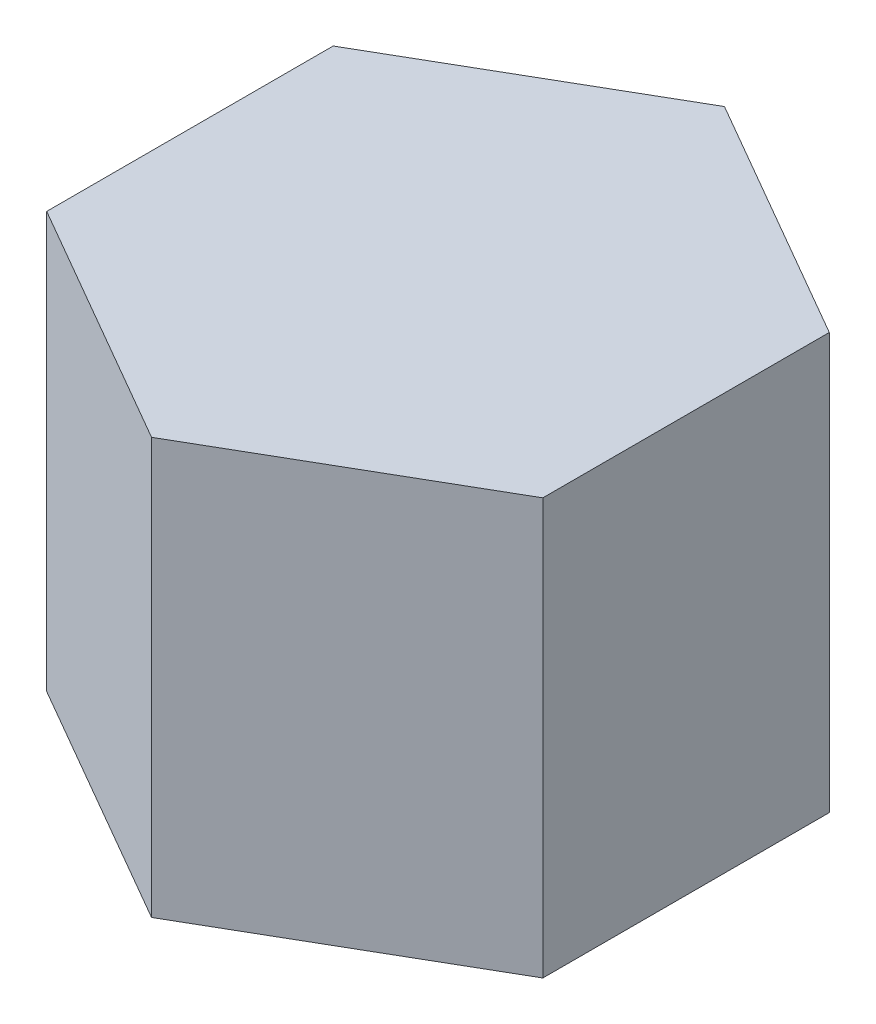
ISO-10303-21;
HEADER;
FILE_DESCRIPTION(('STEP AP214'),'2;1');
FILE_NAME('part.step','',(''),(''),'','','');
FILE_SCHEMA(('AUTOMOTIVE_DESIGN { 1 0 10303 214 1 1 1 1 }'));
ENDSEC;
DATA;
#1=APPLICATION_CONTEXT('core data for automotive mechanical design processes');
#2=APPLICATION_PROTOCOL_DEFINITION('international standard','automotive_design',2000,#1);
#3=PRODUCT_CONTEXT('',#1,'mechanical');
#4=PRODUCT('Part','Part','',(#3));
#5=PRODUCT_RELATED_PRODUCT_CATEGORY('part','',(#4));
#6=PRODUCT_DEFINITION_FORMATION('','',#4);
#7=PRODUCT_DEFINITION_CONTEXT('part definition',#1,'design');
#8=PRODUCT_DEFINITION('design','',#6,#7);
#9=PRODUCT_DEFINITION_SHAPE('','',#8);
#10=(LENGTH_UNIT() NAMED_UNIT(*) SI_UNIT(.MILLI.,.METRE.));
#11=(NAMED_UNIT(*) PLANE_ANGLE_UNIT() SI_UNIT($,.RADIAN.));
#12=(NAMED_UNIT(*) SI_UNIT($,.STERADIAN.) SOLID_ANGLE_UNIT());
#13=UNCERTAINTY_MEASURE_WITH_UNIT(LENGTH_MEASURE(1.E-05),#10,'distance_accuracy_value','');
#14=(GEOMETRIC_REPRESENTATION_CONTEXT(3) GLOBAL_UNCERTAINTY_ASSIGNED_CONTEXT((#13)) GLOBAL_UNIT_ASSIGNED_CONTEXT((#10,
#11,#12)) REPRESENTATION_CONTEXT('',''));
#15=CARTESIAN_POINT('',(0.,0.,0.));
#16=DIRECTION('',(0.,0.,1.));
#17=DIRECTION('',(1.,0.,0.));
#18=AXIS2_PLACEMENT_3D('',#15,#16,#17);
#19=CARTESIAN_POINT('',(210.642660308706,-148.537700895744,289.774920412926));
#20=DIRECTION('',(-0.499999999999943,0.,-0.866025403784472));
#21=DIRECTION('',(-0.866025403784472,0.,0.499999999999943));
#22=AXIS2_PLACEMENT_3D('',#19,#20,#21);
#23=PLANE('',#22);
#24=CARTESIAN_POINT('',(210.339551417382,-149.045793579175,289.949920412926));
#25=DIRECTION('',(0.866025403784471,0.,-0.499999999999943));
#26=VECTOR('',#25,1.);
#27=LINE('',#24,#26);
#28=CARTESIAN_POINT('',(210.339551417382,-149.045793579175,289.949920412926));
#29=VERTEX_POINT('',#28);
#30=CARTESIAN_POINT('',(210.642660308706,-149.045793579175,289.774920412926));
#31=VERTEX_POINT('',#30);
#32=EDGE_CURVE('E170',#29,#31,#27,.T.);
#33=ORIENTED_EDGE('',*,*,#32,.T.);
#34=CARTESIAN_POINT('',(210.642660308706,-148.537700895744,289.774920412926));
#35=DIRECTION('',(0.,-1.,0.));
#36=VECTOR('',#35,1.);
#37=LINE('',#34,#36);
#38=CARTESIAN_POINT('',(210.642660308706,-148.537700895744,289.774920412926));
#39=VERTEX_POINT('',#38);
#40=EDGE_CURVE('E35',#39,#31,#37,.T.);
#41=ORIENTED_EDGE('',*,*,#40,.F.);
#42=CARTESIAN_POINT('',(210.339551417382,-148.537700895744,289.949920412926));
#43=DIRECTION('',(0.866025403784471,0.,-0.499999999999943));
#44=VECTOR('',#43,1.);
#45=LINE('',#42,#44);
#46=CARTESIAN_POINT('',(210.339551417382,-148.537700895744,289.949920412926));
#47=VERTEX_POINT('',#46);
#48=EDGE_CURVE('E159',#47,#39,#45,.T.);
#49=ORIENTED_EDGE('',*,*,#48,.F.);
#50=CARTESIAN_POINT('',(210.339551417382,-148.537700895744,289.949920412926));
#51=DIRECTION('',(0.,-1.,0.));
#52=VECTOR('',#51,1.);
#53=LINE('',#50,#52);
#54=EDGE_CURVE('E10',#47,#29,#53,.T.);
#55=ORIENTED_EDGE('',*,*,#54,.T.);
#56=EDGE_LOOP('',(#33,#41,#49,#55));
#57=FACE_BOUND('',#56,.T.);
#58=ADVANCED_FACE('F16',(#57),#23,.F.);
#59=CARTESIAN_POINT('',(210.339551417382,-148.537700895744,289.949920412926));
#60=DIRECTION('',(0.500000000000062,0.,-0.866025403784403));
#61=DIRECTION('',(-0.866025403784403,0.,-0.500000000000062));
#62=AXIS2_PLACEMENT_3D('',#59,#60,#61);
#63=PLANE('',#62);
#64=CARTESIAN_POINT('',(210.036442526057,-149.045793579175,289.774920412926));
#65=DIRECTION('',(0.866025403784403,0.,0.500000000000062));
#66=VECTOR('',#65,1.);
#67=LINE('',#64,#66);
#68=CARTESIAN_POINT('',(210.036442526057,-149.045793579175,289.774920412926));
#69=VERTEX_POINT('',#68);
#70=EDGE_CURVE('E167',#69,#29,#67,.T.);
#71=ORIENTED_EDGE('',*,*,#70,.T.);
#72=ORIENTED_EDGE('',*,*,#54,.F.);
#73=CARTESIAN_POINT('',(210.036442526057,-148.537700895744,289.774920412926));
#74=DIRECTION('',(0.866025403784403,0.,0.500000000000062));
#75=VECTOR('',#74,1.);
#76=LINE('',#73,#75);
#77=CARTESIAN_POINT('',(210.036442526057,-148.537700895744,289.774920412926));
#78=VERTEX_POINT('',#77);
#79=EDGE_CURVE('E156',#78,#47,#76,.T.);
#80=ORIENTED_EDGE('',*,*,#79,.F.);
#81=CARTESIAN_POINT('',(210.036442526057,-148.537700895744,289.774920412926));
#82=DIRECTION('',(0.,-1.,0.));
#83=VECTOR('',#82,1.);
#84=LINE('',#81,#83);
#85=EDGE_CURVE('E27',#78,#69,#84,.T.);
#86=ORIENTED_EDGE('',*,*,#85,.T.);
#87=EDGE_LOOP('',(#71,#72,#80,#86));
#88=FACE_BOUND('',#87,.T.);
#89=ADVANCED_FACE('F189',(#88),#63,.F.);
#90=CARTESIAN_POINT('',(210.036442526057,-148.537700895744,290.831971220494));
#91=DIRECTION('',(1.,0.,0.));
#92=DIRECTION('',(0.,1.,0.));
#93=AXIS2_PLACEMENT_3D('',#90,#91,#92);
#94=PLANE('',#93);
#95=CARTESIAN_POINT('',(210.036442526057,-149.045793579175,289.424920412926));
#96=DIRECTION('',(0.,0.,1.));
#97=VECTOR('',#96,1.);
#98=LINE('',#95,#97);
#99=CARTESIAN_POINT('',(210.036442526057,-149.045793579175,289.424920412926));
#100=VERTEX_POINT('',#99);
#101=EDGE_CURVE('E163',#100,#69,#98,.T.);
#102=ORIENTED_EDGE('',*,*,#101,.T.);
#103=ORIENTED_EDGE('',*,*,#85,.F.);
#104=CARTESIAN_POINT('',(210.036442526057,-148.537700895744,289.424920412926));
#105=DIRECTION('',(0.,0.,1.));
#106=VECTOR('',#105,1.);
#107=LINE('',#104,#106);
#108=CARTESIAN_POINT('',(210.036442526057,-148.537700895744,289.424920412926));
#109=VERTEX_POINT('',#108);
#110=EDGE_CURVE('E106',#109,#78,#107,.T.);
#111=ORIENTED_EDGE('',*,*,#110,.F.);
#112=CARTESIAN_POINT('',(210.036442526057,-148.537700895744,289.424920412926));
#113=DIRECTION('',(0.,-1.,0.));
#114=VECTOR('',#113,1.);
#115=LINE('',#112,#114);
#116=EDGE_CURVE('E94',#109,#100,#115,.T.);
#117=ORIENTED_EDGE('',*,*,#116,.T.);
#118=EDGE_LOOP('',(#102,#103,#111,#117));
#119=FACE_BOUND('',#118,.T.);
#120=ADVANCED_FACE('F198',(#119),#94,.F.);
#121=CARTESIAN_POINT('',(210.036442526057,-148.537700895744,289.424920412926));
#122=DIRECTION('',(0.499999999999978,0.,0.866025403784452));
#123=DIRECTION('',(0.866025403784452,0.,-0.499999999999978));
#124=AXIS2_PLACEMENT_3D('',#121,#122,#123);
#125=PLANE('',#124);
#126=CARTESIAN_POINT('',(210.339551417382,-149.045793579175,289.249920412926));
#127=DIRECTION('',(-0.866025403784452,0.,0.499999999999978));
#128=VECTOR('',#127,1.);
#129=LINE('',#126,#128);
#130=CARTESIAN_POINT('',(210.339551417382,-149.045793579175,289.249920412926));
#131=VERTEX_POINT('',#130);
#132=EDGE_CURVE('E162',#131,#100,#129,.T.);
#133=ORIENTED_EDGE('',*,*,#132,.T.);
#134=ORIENTED_EDGE('',*,*,#116,.F.);
#135=CARTESIAN_POINT('',(210.339551417382,-148.537700895744,289.249920412926));
#136=DIRECTION('',(-0.866025403784452,0.,0.499999999999978));
#137=VECTOR('',#136,1.);
#138=LINE('',#135,#137);
#139=CARTESIAN_POINT('',(210.339551417382,-148.537700895744,289.249920412926));
#140=VERTEX_POINT('',#139);
#141=EDGE_CURVE('E98',#140,#109,#138,.T.);
#142=ORIENTED_EDGE('',*,*,#141,.F.);
#143=CARTESIAN_POINT('',(210.339551417382,-148.537700895744,289.249920412926));
#144=DIRECTION('',(0.,-1.,0.));
#145=VECTOR('',#144,1.);
#146=LINE('',#143,#145);
#147=EDGE_CURVE('E79',#140,#131,#146,.T.);
#148=ORIENTED_EDGE('',*,*,#147,.T.);
#149=EDGE_LOOP('',(#133,#134,#142,#148));
#150=FACE_BOUND('',#149,.T.);
#151=ADVANCED_FACE('F100',(#150),#125,.F.);
#152=CARTESIAN_POINT('',(210.339551417382,-148.537700895744,289.249920412926));
#153=DIRECTION('',(-0.499999999999978,0.,0.866025403784452));
#154=DIRECTION('',(0.866025403784452,0.,0.499999999999978));
#155=AXIS2_PLACEMENT_3D('',#152,#153,#154);
#156=PLANE('',#155);
#157=CARTESIAN_POINT('',(210.642660308706,-149.045793579175,289.424920412926));
#158=DIRECTION('',(-0.866025403784452,0.,-0.499999999999978));
#159=VECTOR('',#158,1.);
#160=LINE('',#157,#159);
#161=CARTESIAN_POINT('',(210.642660308706,-149.045793579175,289.424920412926));
#162=VERTEX_POINT('',#161);
#163=EDGE_CURVE('E88',#162,#131,#160,.T.);
#164=ORIENTED_EDGE('',*,*,#163,.T.);
#165=ORIENTED_EDGE('',*,*,#147,.F.);
#166=CARTESIAN_POINT('',(210.642660308706,-148.537700895744,289.424920412926));
#167=DIRECTION('',(-0.866025403784452,0.,-0.499999999999978));
#168=VECTOR('',#167,1.);
#169=LINE('',#166,#168);
#170=CARTESIAN_POINT('',(210.642660308706,-148.537700895744,289.424920412926));
#171=VERTEX_POINT('',#170);
#172=EDGE_CURVE('E84',#171,#140,#169,.T.);
#173=ORIENTED_EDGE('',*,*,#172,.F.);
#174=CARTESIAN_POINT('',(210.642660308706,-148.537700895744,289.424920412926));
#175=DIRECTION('',(0.,-1.,0.));
#176=VECTOR('',#175,1.);
#177=LINE('',#174,#176);
#178=EDGE_CURVE('E58',#171,#162,#177,.T.);
#179=ORIENTED_EDGE('',*,*,#178,.T.);
#180=EDGE_LOOP('',(#164,#165,#173,#179));
#181=FACE_BOUND('',#180,.T.);
#182=ADVANCED_FACE('F82',(#181),#156,.F.);
#183=CARTESIAN_POINT('',(210.642660308706,-148.537700895744,290.831971220494));
#184=DIRECTION('',(-1.,0.,0.));
#185=DIRECTION('',(0.,-1.,0.));
#186=AXIS2_PLACEMENT_3D('',#183,#184,#185);
#187=PLANE('',#186);
#188=CARTESIAN_POINT('',(210.642660308706,-149.045793579175,289.774920412926));
#189=DIRECTION('',(0.,0.,-1.));
#190=VECTOR('',#189,1.);
#191=LINE('',#188,#190);
#192=EDGE_CURVE('E160',#31,#162,#191,.T.);
#193=ORIENTED_EDGE('',*,*,#192,.T.);
#194=ORIENTED_EDGE('',*,*,#178,.F.);
#195=CARTESIAN_POINT('',(210.642660308706,-148.537700895744,289.774920412926));
#196=DIRECTION('',(0.,0.,-1.));
#197=VECTOR('',#196,1.);
#198=LINE('',#195,#197);
#199=EDGE_CURVE('E112',#39,#171,#198,.T.);
#200=ORIENTED_EDGE('',*,*,#199,.F.);
#201=ORIENTED_EDGE('',*,*,#40,.T.);
#202=EDGE_LOOP('',(#193,#194,#200,#201));
#203=FACE_BOUND('',#202,.T.);
#204=ADVANCED_FACE('F131',(#203),#187,.F.);
#205=CARTESIAN_POINT('',(206.339551417382,-148.537700895744,290.831971220494));
#206=DIRECTION('',(0.,-1.,0.));
#207=DIRECTION('',(1.,0.,0.));
#208=AXIS2_PLACEMENT_3D('',#205,#206,#207);
#209=PLANE('',#208);
#210=ORIENTED_EDGE('',*,*,#48,.T.);
#211=ORIENTED_EDGE('',*,*,#199,.T.);
#212=ORIENTED_EDGE('',*,*,#172,.T.);
#213=ORIENTED_EDGE('',*,*,#141,.T.);
#214=ORIENTED_EDGE('',*,*,#110,.T.);
#215=ORIENTED_EDGE('',*,*,#79,.T.);
#216=EDGE_LOOP('',(#210,#211,#212,#213,#214,#215));
#217=FACE_BOUND('',#216,.T.);
#218=ADVANCED_FACE('F111',(#217),#209,.F.);
#219=CARTESIAN_POINT('',(206.339551417382,-149.045793579175,290.831971220494));
#220=DIRECTION('',(0.,-1.,0.));
#221=DIRECTION('',(1.,0.,0.));
#222=AXIS2_PLACEMENT_3D('',#219,#220,#221);
#223=PLANE('',#222);
#224=ORIENTED_EDGE('',*,*,#32,.F.);
#225=ORIENTED_EDGE('',*,*,#70,.F.);
#226=ORIENTED_EDGE('',*,*,#101,.F.);
#227=ORIENTED_EDGE('',*,*,#132,.F.);
#228=ORIENTED_EDGE('',*,*,#163,.F.);
#229=ORIENTED_EDGE('',*,*,#192,.F.);
#230=EDGE_LOOP('',(#224,#225,#226,#227,#228,#229));
#231=FACE_BOUND('',#230,.T.);
#232=ADVANCED_FACE('F130',(#231),#223,.T.);
#233=CLOSED_SHELL('',(#58,#89,#120,#151,#182,#204,#218,#232));
#234=MANIFOLD_SOLID_BREP('B1',#233);
#235=ADVANCED_BREP_SHAPE_REPRESENTATION('',(#18,#234),#14);
#236=SHAPE_DEFINITION_REPRESENTATION(#9,#235);
ENDSEC;
END-ISO-10303-21;
